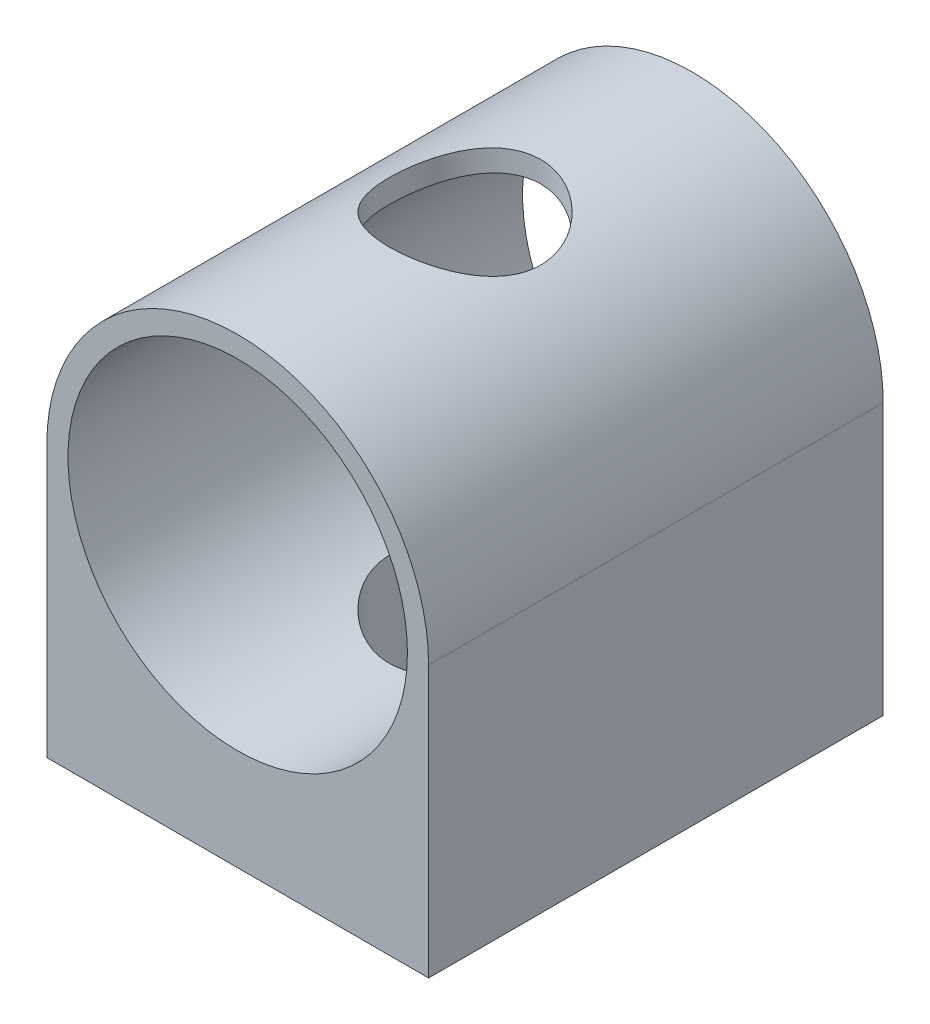
ISO-10303-21;
HEADER;
FILE_DESCRIPTION(('STEP AP214'),'2;1');
FILE_NAME('part.step','',(''),(''),'','','');
FILE_SCHEMA(('AUTOMOTIVE_DESIGN { 1 0 10303 214 1 1 1 1 }'));
ENDSEC;
DATA;
#1=APPLICATION_CONTEXT('core data for automotive mechanical design processes');
#2=APPLICATION_PROTOCOL_DEFINITION('international standard','automotive_design',2000,#1);
#3=PRODUCT_CONTEXT('',#1,'mechanical');
#4=PRODUCT('Part','Part','',(#3));
#5=PRODUCT_RELATED_PRODUCT_CATEGORY('part','',(#4));
#6=PRODUCT_DEFINITION_FORMATION('','',#4);
#7=PRODUCT_DEFINITION_CONTEXT('part definition',#1,'design');
#8=PRODUCT_DEFINITION('design','',#6,#7);
#9=PRODUCT_DEFINITION_SHAPE('','',#8);
#10=(LENGTH_UNIT() NAMED_UNIT(*) SI_UNIT(.MILLI.,.METRE.));
#11=(NAMED_UNIT(*) PLANE_ANGLE_UNIT() SI_UNIT($,.RADIAN.));
#12=(NAMED_UNIT(*) SI_UNIT($,.STERADIAN.) SOLID_ANGLE_UNIT());
#13=UNCERTAINTY_MEASURE_WITH_UNIT(LENGTH_MEASURE(1.E-05),#10,'distance_accuracy_value','');
#14=(GEOMETRIC_REPRESENTATION_CONTEXT(3) GLOBAL_UNCERTAINTY_ASSIGNED_CONTEXT((#13)) GLOBAL_UNIT_ASSIGNED_CONTEXT((#10,
#11,#12)) REPRESENTATION_CONTEXT('',''));
#15=CARTESIAN_POINT('',(0.,0.,0.));
#16=DIRECTION('',(0.,0.,1.));
#17=DIRECTION('',(1.,0.,0.));
#18=AXIS2_PLACEMENT_3D('',#15,#16,#17);
#19=CARTESIAN_POINT('',(0.,22.7096,38.1));
#20=DIRECTION('',(0.,0.,-1.));
#21=DIRECTION('',(-1.,0.,0.));
#22=AXIS2_PLACEMENT_3D('',#19,#20,#21);
#23=CYLINDRICAL_SURFACE('',#22,16.);
#24=CARTESIAN_POINT('',(0.,38.7096,12.7));
#25=CARTESIAN_POINT('',(-0.170861312202262,38.709599043328,12.7000012262265));
#26=CARTESIAN_POINT('',(-0.341776530837453,38.7068556430779,12.7069051153827));
#27=CARTESIAN_POINT('',(-0.682395770162633,38.695950644064,12.7344586577073));
#28=CARTESIAN_POINT('',(-0.852098982936762,38.6877857202998,12.7551167462964));
#29=CARTESIAN_POINT('',(-1.18930725405154,38.6662332196404,12.8100254293467));
#30=CARTESIAN_POINT('',(-1.3568072688556,38.6528352871156,12.8443029777687));
#31=CARTESIAN_POINT('',(-1.68812912054467,38.6211659584417,12.9261243454308));
#32=CARTESIAN_POINT('',(-1.85194943642102,38.6028925858006,12.9736735453292));
#33=CARTESIAN_POINT('',(-2.17415881861672,38.5620229148839,13.081391722777));
#34=CARTESIAN_POINT('',(-2.3325653637188,38.5394424677403,13.1415145022246));
#35=CARTESIAN_POINT('',(-2.64363131789985,38.4904751228965,13.2739886496563));
#36=CARTESIAN_POINT('',(-2.79628855542638,38.4640868047642,13.3463445826527));
#37=CARTESIAN_POINT('',(-3.09480551100628,38.4081736303095,13.5026549850836));
#38=CARTESIAN_POINT('',(-3.24067003972653,38.3786510438463,13.5866010739078));
#39=CARTESIAN_POINT('',(-3.52494064653913,38.3171618173969,13.7655381126562));
#40=CARTESIAN_POINT('',(-3.66334399949079,38.2851942945891,13.8605330586293));
#41=CARTESIAN_POINT('',(-4.07750762283226,38.1839883885454,14.1696088303929));
#42=CARTESIAN_POINT('',(-4.33974143093637,38.1118706176638,14.4012666241225));
#43=CARTESIAN_POINT('',(-4.82278664246711,37.9675328963272,14.9045262286927));
#44=CARTESIAN_POINT('',(-5.04357869030205,37.8953129139209,15.17614659914));
#45=CARTESIAN_POINT('',(-5.34388377896921,37.7912051461428,15.6150670500334));
#46=CARTESIAN_POINT('',(-5.44051079968249,37.7565273110308,15.770238276024));
#47=CARTESIAN_POINT('',(-5.62026090038177,37.6903154436988,16.088821936644));
#48=CARTESIAN_POINT('',(-5.70338952722931,37.6587801222018,16.2522309497807));
#49=CARTESIAN_POINT('',(-5.85544182567696,37.5998806276356,16.5862656758467));
#50=CARTESIAN_POINT('',(-5.92436442582577,37.5725167692282,16.7568919319482));
#51=CARTESIAN_POINT('',(-6.04729484179053,37.5229258228666,17.1040781793128));
#52=CARTESIAN_POINT('',(-6.10131009325503,37.5006961749214,17.2806351629073));
#53=CARTESIAN_POINT('',(-6.19181425751467,37.4630312115089,17.6304526824964));
#54=CARTESIAN_POINT('',(-6.22897459218138,37.4473381503095,17.8035117801317));
#55=CARTESIAN_POINT('',(-6.28874309778733,37.4219339012518,18.1524863904489));
#56=CARTESIAN_POINT('',(-6.31135781337091,37.4122200232094,18.3284005819328));
#57=CARTESIAN_POINT('',(-6.34178916095858,37.3991196002584,18.68170417215));
#58=CARTESIAN_POINT('',(-6.34960880620162,37.3957317669573,18.8590932631045));
#59=CARTESIAN_POINT('',(-6.35036248913086,37.395406015646,19.2139049208976));
#60=CARTESIAN_POINT('',(-6.34329720541543,37.3984678036,19.3913274858416));
#61=CARTESIAN_POINT('',(-6.3153647696582,37.4104970709356,19.7325982844976));
#62=CARTESIAN_POINT('',(-6.29547773947501,37.4190449835049,19.8965427266339));
#63=CARTESIAN_POINT('',(-6.24306728193208,37.4413657380813,20.2220926412286));
#64=CARTESIAN_POINT('',(-6.2105396907535,37.4551403017192,20.3836973247539));
#65=CARTESIAN_POINT('',(-6.13317486135991,37.4874861772289,20.7033934097786));
#66=CARTESIAN_POINT('',(-6.08834061368485,37.5060563237004,20.8614856547315));
#67=CARTESIAN_POINT('',(-5.98674297513237,37.547454134367,21.1732768957367));
#68=CARTESIAN_POINT('',(-5.92997500245535,37.5702834334288,21.3269741785777));
#69=CARTESIAN_POINT('',(-5.80374148721631,37.6200418224411,21.6320285876702));
#70=CARTESIAN_POINT('',(-5.73404646211998,37.6470432379367,21.7832788602833));
#71=CARTESIAN_POINT('',(-5.58324269734292,37.7040622490555,22.0794432470055));
#72=CARTESIAN_POINT('',(-5.50213009090664,37.7340808655155,22.2243551926505));
#73=CARTESIAN_POINT('',(-5.32904345677988,37.7963409559348,22.5070609140729));
#74=CARTESIAN_POINT('',(-5.23706800297398,37.8285827215257,22.6448537518061));
#75=CARTESIAN_POINT('',(-5.04281731288829,37.8944777238708,22.9126228920072));
#76=CARTESIAN_POINT('',(-4.94054155350033,37.9281310322605,23.0425987969509));
#77=CARTESIAN_POINT('',(-4.71807865780254,37.998627513027,23.3036860566165));
#78=CARTESIAN_POINT('',(-4.59712044782472,38.0355182762276,23.4341285528025));
#79=CARTESIAN_POINT('',(-4.34468446281968,38.1089827791516,23.6844148407742));
#80=CARTESIAN_POINT('',(-4.21320981254515,38.1455566094918,23.8042617587088));
#81=CARTESIAN_POINT('',(-3.94038183385994,38.2174463770338,24.0327266500398));
#82=CARTESIAN_POINT('',(-3.79902291543887,38.2527615851025,24.1413381818033));
#83=CARTESIAN_POINT('',(-3.50736624204196,38.3211600070704,24.3464757116519));
#84=CARTESIAN_POINT('',(-3.35707209229006,38.3542441098384,24.4430065359464));
#85=CARTESIAN_POINT('',(-3.04534665939045,38.4179309245192,24.625085658418));
#86=CARTESIAN_POINT('',(-2.88375437869337,38.4484719687789,24.7103803544405));
#87=CARTESIAN_POINT('',(-2.55328429322685,38.5054487448903,24.8669281491802));
#88=CARTESIAN_POINT('',(-2.38440944762515,38.5318861244935,24.9381868868872));
#89=CARTESIAN_POINT('',(-2.04054543409784,38.5798961992803,25.0660045725695));
#90=CARTESIAN_POINT('',(-1.86555744934644,38.6014698298648,25.1225663473982));
#91=CARTESIAN_POINT('',(-1.510782536292,38.6391117916624,25.2204042195122));
#92=CARTESIAN_POINT('',(-1.33099593529772,38.6551804973317,25.2616813565052));
#93=CARTESIAN_POINT('',(-0.978705290553125,38.6805574184353,25.3265289286285));
#94=CARTESIAN_POINT('',(-0.806389903976416,38.6902059226333,25.3509933942444));
#95=CARTESIAN_POINT('',(-0.46011467234715,38.7039212259755,25.3856978720066));
#96=CARTESIAN_POINT('',(-0.28615490710707,38.7079882946369,25.3959385709925));
#97=CARTESIAN_POINT('',(0.0620189041538971,38.7104267434407,25.4020834424189));
#98=CARTESIAN_POINT('',(0.236232886872477,38.708799358178,25.3979907224385));
#99=CARTESIAN_POINT('',(0.58358927634936,38.6998972246188,25.3755206939272));
#100=CARTESIAN_POINT('',(0.756731703019357,38.6926225815794,25.3571436516363));
#101=CARTESIAN_POINT('',(1.09298165708702,38.6730735964147,25.3074343151066));
#102=CARTESIAN_POINT('',(1.25619372464942,38.6610352464378,25.2767125951425));
#103=CARTESIAN_POINT('',(1.57937361677899,38.6322852568071,25.2026879499187));
#104=CARTESIAN_POINT('',(1.73934036048702,38.6155720867393,25.1593809043706));
#105=CARTESIAN_POINT('',(2.05489920216421,38.5778902359754,25.0605921213468));
#106=CARTESIAN_POINT('',(2.21049249792092,38.5569227336314,25.005113754702));
#107=CARTESIAN_POINT('',(2.51646945889709,38.5112240208074,24.8824148524431));
#108=CARTESIAN_POINT('',(2.66685111666824,38.4864913794031,24.8151898511313));
#109=CARTESIAN_POINT('',(2.96593144464977,38.4330543478335,24.6673311823123));
#110=CARTESIAN_POINT('',(3.11444334387994,38.404252847103,24.5863549375562));
#111=CARTESIAN_POINT('',(3.40419071895505,38.3439658091035,24.4130675223671));
#112=CARTESIAN_POINT('',(3.54542367688184,38.3124793529256,24.3207524664994));
#113=CARTESIAN_POINT('',(3.81983494449165,38.2475774985433,24.1254045708746));
#114=CARTESIAN_POINT('',(3.95301190800878,38.2141617797702,24.0223699476465));
#115=CARTESIAN_POINT('',(4.21060552246683,38.1461977080394,23.8062142478614));
#116=CARTESIAN_POINT('',(4.33502179933754,38.1116493068097,23.693092741074));
#117=CARTESIAN_POINT('',(4.5822714746113,38.0399757006974,23.4496944712885));
#118=CARTESIAN_POINT('',(4.70447181338758,38.0028294585885,23.3187799407483));
#119=CARTESIAN_POINT('',(4.93743044758057,37.9292157183176,23.0470364612911));
#120=CARTESIAN_POINT('',(5.04819230918582,37.8927480115324,22.9062106255987));
#121=CARTESIAN_POINT('',(5.2576647030766,37.8214897220194,22.6153330987166));
#122=CARTESIAN_POINT('',(5.35636843607658,37.7867000921478,22.4652762734387));
#123=CARTESIAN_POINT('',(5.54090568874265,37.7198629802257,22.1569485506035));
#124=CARTESIAN_POINT('',(5.62674461936163,37.6878143477571,21.9986811443463));
#125=CARTESIAN_POINT('',(5.7856566478339,37.6271562235821,21.673311331528));
#126=CARTESIAN_POINT('',(5.85860162560473,37.5985820424278,21.5061396421106));
#127=CARTESIAN_POINT('',(5.9900124207279,37.5462019751125,21.165549891302));
#128=CARTESIAN_POINT('',(6.0484844187599,37.5223940543553,20.9921345326344));
#129=CARTESIAN_POINT('',(6.15035460081698,37.4803879899287,20.6403329592044));
#130=CARTESIAN_POINT('',(6.19375856836003,37.4621876942034,20.4619486801108));
#131=CARTESIAN_POINT('',(6.26501421402056,37.4320692313111,20.101581461426));
#132=CARTESIAN_POINT('',(6.29286716539163,37.4201505498357,19.9195988177178));
#133=CARTESIAN_POINT('',(6.33126109112654,37.4036645454593,19.5666032013181));
#134=CARTESIAN_POINT('',(6.34289148986952,37.398635069764,19.3957295149974));
#135=CARTESIAN_POINT('',(6.35230509395225,37.3945667637835,19.0535321325364));
#136=CARTESIAN_POINT('',(6.3500888714148,37.3955276859836,18.8822084552815));
#137=CARTESIAN_POINT('',(6.33183615508133,37.4034064452635,18.5404602946909));
#138=CARTESIAN_POINT('',(6.31580128536922,37.4103235823187,18.3700357080546));
#139=CARTESIAN_POINT('',(6.27009350175508,37.4298766116166,18.0313612166373));
#140=CARTESIAN_POINT('',(6.2404206429364,37.4425124807616,17.8631113030757));
#141=CARTESIAN_POINT('',(6.16915806358407,37.47248991771,17.5364444111192));
#142=CARTESIAN_POINT('',(6.1280724558307,37.4896310543757,17.3778985472037));
#143=CARTESIAN_POINT('',(6.03395186906785,37.5283048024728,17.0648942771248));
#144=CARTESIAN_POINT('',(5.980913005517,37.5498388412832,16.9104372180069));
#145=CARTESIAN_POINT('',(5.86333682263022,37.5966843825044,16.6065783818654));
#146=CARTESIAN_POINT('',(5.79880114006261,37.6219953471223,16.4571758888361));
#147=CARTESIAN_POINT('',(5.65870924800364,37.6757162574973,16.1641878091589));
#148=CARTESIAN_POINT('',(5.58314903773539,37.704127327328,16.0206043585023));
#149=CARTESIAN_POINT('',(5.33157246378825,37.7962634604685,15.5839251619779));
#150=CARTESIAN_POINT('',(5.13723630294805,37.8641451497217,15.3020032040189));
#151=CARTESIAN_POINT('',(4.70635259970448,38.003433417728,14.7734246850641));
#152=CARTESIAN_POINT('',(4.46978989963665,38.0748412555493,14.5267808449804));
#153=CARTESIAN_POINT('',(4.07925188126439,38.1814957689075,14.1801791213555));
#154=CARTESIAN_POINT('',(3.93839077270907,38.2180363985486,14.065564160115));
#155=CARTESIAN_POINT('',(3.64705884821258,38.2891187299814,13.8486146128115));
#156=CARTESIAN_POINT('',(3.49659130701243,38.3236611053857,13.7462758757887));
#157=CARTESIAN_POINT('',(3.18689171359499,38.3898044192546,13.5546012557618));
#158=CARTESIAN_POINT('',(3.02765599152599,38.4214041109611,13.4652708751925));
#159=CARTESIAN_POINT('',(2.70151378893873,38.480753399903,13.3004177813787));
#160=CARTESIAN_POINT('',(2.5346083467284,38.5085035162524,13.2248932059891));
#161=CARTESIAN_POINT('',(2.20891378860262,38.5571688759309,13.0942220663304));
#162=CARTESIAN_POINT('',(2.05065963733572,38.5784665316674,13.0378820987823));
#163=CARTESIAN_POINT('',(1.72970178125004,38.6166499389506,12.9378089499164));
#164=CARTESIAN_POINT('',(1.5669985524731,38.6335361604866,12.8940744255772));
#165=CARTESIAN_POINT('',(1.23861173002842,38.6624351809076,12.8197013279836));
#166=CARTESIAN_POINT('',(1.07293607738946,38.6744593885241,12.7890320878254));
#167=CARTESIAN_POINT('',(0.739450357600824,38.6933752527438,12.740953773931));
#168=CARTESIAN_POINT('',(0.571641598717065,38.7002699142263,12.7235369368236));
#169=CARTESIAN_POINT('',(0.33625946124026,38.7062074590537,12.7085522109113));
#170=CARTESIAN_POINT('',(0.269058624314224,38.7074788967965,12.7053460972204));
#171=CARTESIAN_POINT('',(0.134574648338729,38.7091753797746,12.7010696894364));
#172=CARTESIAN_POINT('',(0.0672915048173895,38.7096003767728,12.6999995170666));
#173=CARTESIAN_POINT('',(0.,38.7096,12.7));
#174=B_SPLINE_CURVE_WITH_KNOTS('',3,(#24,#25,#26,#27,#28,#29,#30,#31,#32,#33,#34,#35,#36,#37,
#38,#39,#40,#41,#42,#43,#44,#45,#46,#47,#48,#49,#50,#51,#52,#53,#54,#55,#56,#57,#58,#59,#60,#61,
#62,#63,#64,#65,#66,#67,#68,#69,#70,#71,#72,#73,#74,#75,#76,#77,#78,#79,#80,#81,#82,#83,#84,#85,
#86,#87,#88,#89,#90,#91,#92,#93,#94,#95,#96,#97,#98,#99,#100,#101,#102,#103,#104,#105,#106,#107,
#108,#109,#110,#111,#112,#113,#114,#115,#116,#117,#118,#119,#120,#121,#122,#123,#124,#125,#126,
#127,#128,#129,#130,#131,#132,#133,#134,#135,#136,#137,#138,#139,#140,#141,#142,#143,#144,#145,
#146,#147,#148,#149,#150,#151,#152,#153,#154,#155,#156,#157,#158,#159,#160,#161,#162,#163,#164,
#165,#166,#167,#168,#169,#170,#171,#172,#173),.UNSPECIFIED.,.T.,.F.,(4,2,2,2,2,2,2,2,2,2,2,2,2,
2,2,2,2,2,2,2,2,2,2,2,2,2,2,2,2,2,2,2,2,2,2,2,2,2,2,2,2,2,2,2,2,2,2,2,2,2,2,2,2,2,2,2,2,2,2,2,2,
2,2,2,2,2,2,2,2,2,2,2,2,2,4),(0.,0.512516764918457,1.025348145151,1.53919955431165,
2.05325959500886,2.56546304466988,3.07785805547786,3.58988448537833,4.10209667952118,
5.1688840092163,6.23616835441497,6.79375113152952,7.35110419950001,7.90849928895488,
8.46561585030638,8.99800799181792,9.53016042134932,10.0622044583505,10.5942242401869,
11.0897451329142,11.5854293894765,12.0809933003323,12.5767478251856,13.0823337569653,
13.5880913277197,14.093915370189,14.59976511425,15.1441790935061,15.6884319075357,
16.2329950508391,16.7773399434453,17.3324004680885,17.8872375385543,18.4419678110279,
18.9966603421198,19.5189270867001,20.0411686110975,20.563296917119,21.0854154916254,
21.5843830248245,22.0835140985422,22.5825071126977,23.0816902425362,23.5958925422322,
24.1102715361684,24.6247362473259,25.13922291217,25.6872817585697,26.235169216819,
26.7833642033105,27.3313279672532,27.884463031449,28.4373614704226,28.9900474567648,
29.5426881848008,30.0560632525193,30.5694171084471,31.0827106389288,31.5960020962542,
32.0894837351805,32.583125976472,33.0766979954505,33.570449578202,34.6129160496242,
35.6557574807375,36.2109084089216,36.7658710916147,37.3210678415971,37.8761896505648,
38.3836104729646,38.890977213235,39.3971464088552,39.9030188574572,40.1048554152466,
40.3067034750032),.UNSPECIFIED.);
#175=CARTESIAN_POINT('',(0.,38.7096,12.7));
#176=VERTEX_POINT('',#175);
#177=EDGE_CURVE('E110',#176,#176,#174,.T.);
#178=ORIENTED_EDGE('',*,*,#177,.F.);
#179=EDGE_LOOP('',(#178));
#180=FACE_BOUND('',#179,.T.);
#181=CARTESIAN_POINT('',(0.,22.7096,0.));
#182=DIRECTION('',(0.,0.,1.));
#183=DIRECTION('',(1.,0.,0.));
#184=AXIS2_PLACEMENT_3D('',#181,#182,#183);
#185=CIRCLE('',#184,16.);
#186=CARTESIAN_POINT('',(-16.,22.7096,0.));
#187=VERTEX_POINT('',#186);
#188=CARTESIAN_POINT('',(16.,22.7096,0.));
#189=VERTEX_POINT('',#188);
#190=EDGE_CURVE('E109',#187,#189,#185,.F.);
#191=ORIENTED_EDGE('',*,*,#190,.F.);
#192=DIRECTION('',(0.,0.,-1.));
#193=VECTOR('',#192,1.);
#194=CARTESIAN_POINT('',(-16.,22.7096,38.1));
#195=LINE('',#194,#193);
#196=CARTESIAN_POINT('',(-16.,22.7096,38.1));
#197=VERTEX_POINT('',#196);
#198=EDGE_CURVE('E11',#197,#187,#195,.T.);
#199=ORIENTED_EDGE('',*,*,#198,.F.);
#200=CARTESIAN_POINT('',(0.,22.7096,38.1));
#201=DIRECTION('',(0.,0.,1.));
#202=DIRECTION('',(1.,0.,0.));
#203=AXIS2_PLACEMENT_3D('',#200,#201,#202);
#204=CIRCLE('',#203,16.);
#205=CARTESIAN_POINT('',(16.,22.7096,38.1));
#206=VERTEX_POINT('',#205);
#207=EDGE_CURVE('E99',#197,#206,#204,.F.);
#208=ORIENTED_EDGE('',*,*,#207,.T.);
#209=DIRECTION('',(0.,0.,-1.));
#210=VECTOR('',#209,1.);
#211=CARTESIAN_POINT('',(16.,22.7096,38.1));
#212=LINE('',#211,#210);
#213=EDGE_CURVE('E80',#206,#189,#212,.T.);
#214=ORIENTED_EDGE('',*,*,#213,.T.);
#215=EDGE_LOOP('',(#191,#199,#208,#214));
#216=FACE_BOUND('',#215,.T.);
#217=ADVANCED_FACE('F34',(#180,#216),#23,.T.);
#218=CARTESIAN_POINT('',(-16.,0.,38.1));
#219=DIRECTION('',(-1.,0.,0.));
#220=DIRECTION('',(0.,0.,1.));
#221=AXIS2_PLACEMENT_3D('',#218,#219,#220);
#222=PLANE('',#221);
#223=DIRECTION('',(0.,1.,0.));
#224=VECTOR('',#223,1.);
#225=CARTESIAN_POINT('',(-16.,0.,0.));
#226=LINE('',#225,#224);
#227=CARTESIAN_POINT('',(-16.,0.,0.));
#228=VERTEX_POINT('',#227);
#229=EDGE_CURVE('E91',#228,#187,#226,.T.);
#230=ORIENTED_EDGE('',*,*,#229,.F.);
#231=DIRECTION('',(0.,0.,-1.));
#232=VECTOR('',#231,1.);
#233=CARTESIAN_POINT('',(-16.,0.,38.1));
#234=LINE('',#233,#232);
#235=CARTESIAN_POINT('',(-16.,0.,38.1));
#236=VERTEX_POINT('',#235);
#237=EDGE_CURVE('E49',#236,#228,#234,.T.);
#238=ORIENTED_EDGE('',*,*,#237,.F.);
#239=DIRECTION('',(0.,1.,0.));
#240=VECTOR('',#239,1.);
#241=CARTESIAN_POINT('',(-16.,0.,38.1));
#242=LINE('',#241,#240);
#243=EDGE_CURVE('E89',#236,#197,#242,.T.);
#244=ORIENTED_EDGE('',*,*,#243,.T.);
#245=ORIENTED_EDGE('',*,*,#198,.T.);
#246=EDGE_LOOP('',(#230,#238,#244,#245));
#247=FACE_BOUND('',#246,.T.);
#248=ADVANCED_FACE('F88',(#247),#222,.T.);
#249=CARTESIAN_POINT('',(0.,0.,38.1));
#250=DIRECTION('',(0.,-1.,0.));
#251=DIRECTION('',(0.,0.,-1.));
#252=AXIS2_PLACEMENT_3D('',#249,#250,#251);
#253=PLANE('',#252);
#254=CARTESIAN_POINT('',(0.,0.,19.05));
#255=DIRECTION('',(0.,-1.,0.));
#256=DIRECTION('',(0.,0.,-1.));
#257=AXIS2_PLACEMENT_3D('',#254,#255,#256);
#258=CIRCLE('',#257,6.35);
#259=CARTESIAN_POINT('',(0.,0.,12.7));
#260=VERTEX_POINT('',#259);
#261=EDGE_CURVE('E125',#260,#260,#258,.T.);
#262=ORIENTED_EDGE('',*,*,#261,.F.);
#263=EDGE_LOOP('',(#262));
#264=FACE_BOUND('',#263,.T.);
#265=DIRECTION('',(-1.,0.,0.));
#266=VECTOR('',#265,1.);
#267=CARTESIAN_POINT('',(0.,0.,0.));
#268=LINE('',#267,#266);
#269=CARTESIAN_POINT('',(16.,0.,0.));
#270=VERTEX_POINT('',#269);
#271=EDGE_CURVE('E114',#270,#228,#268,.T.);
#272=ORIENTED_EDGE('',*,*,#271,.F.);
#273=DIRECTION('',(0.,0.,-1.));
#274=VECTOR('',#273,1.);
#275=CARTESIAN_POINT('',(16.,0.,38.1));
#276=LINE('',#275,#274);
#277=CARTESIAN_POINT('',(16.,0.,38.1));
#278=VERTEX_POINT('',#277);
#279=EDGE_CURVE('E73',#278,#270,#276,.T.);
#280=ORIENTED_EDGE('',*,*,#279,.F.);
#281=DIRECTION('',(-1.,0.,0.));
#282=VECTOR('',#281,1.);
#283=CARTESIAN_POINT('',(0.,0.,38.1));
#284=LINE('',#283,#282);
#285=EDGE_CURVE('E98',#278,#236,#284,.T.);
#286=ORIENTED_EDGE('',*,*,#285,.T.);
#287=ORIENTED_EDGE('',*,*,#237,.T.);
#288=EDGE_LOOP('',(#272,#280,#286,#287));
#289=FACE_BOUND('',#288,.T.);
#290=ADVANCED_FACE('F101',(#264,#289),#253,.T.);
#291=CARTESIAN_POINT('',(0.,22.7096,38.1));
#292=DIRECTION('',(0.,0.,-1.));
#293=DIRECTION('',(-1.,0.,0.));
#294=AXIS2_PLACEMENT_3D('',#291,#292,#293);
#295=CYLINDRICAL_SURFACE('',#294,14.224);
#296=CARTESIAN_POINT('',(0.,36.9336,12.7));
#297=CARTESIAN_POINT('',(0.169064131729769,36.9335989454365,12.7000012584684));
#298=CARTESIAN_POINT('',(0.338170293414768,36.9305778895958,12.7067605937601));
#299=CARTESIAN_POINT('',(0.675164422776245,36.9185685890767,12.7337310123368));
#300=CARTESIAN_POINT('',(0.84305164561125,36.9095769629898,12.7539497182984));
#301=CARTESIAN_POINT('',(1.17659843144288,36.8858405036873,12.8076686612514));
#302=CARTESIAN_POINT('',(1.3422532667633,36.8710849937836,12.8411935477124));
#303=CARTESIAN_POINT('',(1.66989459320146,36.8361985270013,12.9211824801619));
#304=CARTESIAN_POINT('',(1.83187955533246,36.8160653727319,12.9676518157917));
#305=CARTESIAN_POINT('',(2.1503925253457,36.7710279364772,13.0728494579981));
#306=CARTESIAN_POINT('',(2.30693987451225,36.7461431859962,13.1315276654265));
#307=CARTESIAN_POINT('',(2.61436305128336,36.6921481897339,13.2607493484293));
#308=CARTESIAN_POINT('',(2.76523672788118,36.6630363613131,13.3312972696622));
#309=CARTESIAN_POINT('',(3.06032218322675,36.6012990738707,13.4836301388976));
#310=CARTESIAN_POINT('',(3.20453829419942,36.5686759471269,13.5654076378157));
#311=CARTESIAN_POINT('',(3.48569666746665,36.5006499149219,13.739651131281));
#312=CARTESIAN_POINT('',(3.62263625501127,36.4652459989702,13.8321210170725));
#313=CARTESIAN_POINT('',(4.03500412909824,36.3523491781487,14.1345977715936));
#314=CARTESIAN_POINT('',(4.29702558535442,36.2714075704459,14.3619816936049));
#315=CARTESIAN_POINT('',(4.78065056902209,36.1085880389265,14.8562507051933));
#316=CARTESIAN_POINT('',(5.00222978854212,36.0267095832257,15.1231593777922));
#317=CARTESIAN_POINT('',(5.30621568033236,35.9072917762748,15.5571098361733));
#318=CARTESIAN_POINT('',(5.40507304101554,35.8670063970087,15.7120993110015));
#319=CARTESIAN_POINT('',(5.58927624131655,35.7898190265538,16.0306777193701));
#320=CARTESIAN_POINT('',(5.67462772885047,35.7529156238141,16.1942630199631));
#321=CARTESIAN_POINT('',(5.83107812880833,35.6837292300982,16.5290528050544));
#322=CARTESIAN_POINT('',(5.90217701861777,35.651446246453,16.7002573016415));
#323=CARTESIAN_POINT('',(6.02935119148151,35.5926901247516,17.0490376298518));
#324=CARTESIAN_POINT('',(6.08543458216381,35.5662138527603,17.2266099641824));
#325=CARTESIAN_POINT('',(6.17941066513844,35.5212989603364,17.5773823848697));
#326=CARTESIAN_POINT('',(6.21810297278447,35.5025116873767,17.7503235267035));
#327=CARTESIAN_POINT('',(6.28093882906494,35.471778960995,18.0993533745766));
#328=CARTESIAN_POINT('',(6.30508940813675,35.4598302015199,18.2754405171617));
#329=CARTESIAN_POINT('',(6.33853971923257,35.4432342324333,18.6293011454056));
#330=CARTESIAN_POINT('',(6.347844744329,35.4385844204456,18.807074007282));
#331=CARTESIAN_POINT('',(6.35148865273605,35.4367668063681,19.1628057756843));
#332=CARTESIAN_POINT('',(6.34582851131983,35.4395985167108,19.340764669331));
#333=CARTESIAN_POINT('',(6.32081807462496,35.4520330938839,19.6791934553593));
#334=CARTESIAN_POINT('',(6.30275741103481,35.4609978428272,19.8397842428957));
#335=CARTESIAN_POINT('',(6.25453306144935,35.4847209170416,20.1587562469355));
#336=CARTESIAN_POINT('',(6.22436546854594,35.4994811124708,20.3171367330857));
#337=CARTESIAN_POINT('',(6.15225191906018,35.5343249950343,20.6305539174411));
#338=CARTESIAN_POINT('',(6.11030831443204,35.554407619106,20.7855912766983));
#339=CARTESIAN_POINT('',(6.01502717545125,35.5993011825212,21.0914762718885));
#340=CARTESIAN_POINT('',(5.96168522056779,35.6241139559167,21.2423222565925));
#341=CARTESIAN_POINT('',(5.84276161844015,35.678357486444,21.5422318062413));
#342=CARTESIAN_POINT('',(5.77693555937324,35.7078781705812,21.6911823329245));
#343=CARTESIAN_POINT('',(5.63437970471473,35.7703046943084,21.9830336632301));
#344=CARTESIAN_POINT('',(5.55764624601261,35.8032116701121,22.1259324134297));
#345=CARTESIAN_POINT('',(5.31177387979408,35.9057624273931,22.5445848151583));
#346=CARTESIAN_POINT('',(5.12690085590811,35.9792656267034,22.8104502785898));
#347=CARTESIAN_POINT('',(4.81162285348535,36.0955891191241,23.1975596586336));
#348=CARTESIAN_POINT('',(4.69417522661855,36.1373224376545,23.3300191311469));
#349=CARTESIAN_POINT('',(4.44861453742545,36.22066185828,23.5847069200473));
#350=CARTESIAN_POINT('',(4.32050443238618,36.2622679923533,23.7069380545738));
#351=CARTESIAN_POINT('',(4.0542217604112,36.3442942414802,23.9405203103953));
#352=CARTESIAN_POINT('',(3.91604244673153,36.3847135353872,24.0518640175235));
#353=CARTESIAN_POINT('',(3.63048073575632,36.4632795817658,24.2628306850293));
#354=CARTESIAN_POINT('',(3.48310204162087,36.501427236743,24.3624583156632));
#355=CARTESIAN_POINT('',(3.17526288425157,36.5755908790356,24.5521709467576));
#356=CARTESIAN_POINT('',(3.01454010990181,36.6115059080407,24.6418706226948));
#357=CARTESIAN_POINT('',(2.68521731677174,36.6788524691579,24.8072599733338));
#358=CARTESIAN_POINT('',(2.51662057970846,36.7102858473847,24.882955420607));
#359=CARTESIAN_POINT('',(2.17271141392278,36.7677606990394,25.0195936883149));
#360=CARTESIAN_POINT('',(1.99740095412563,36.793803739151,25.0805407961786));
#361=CARTESIAN_POINT('',(1.64137231314383,36.8397194515932,25.187011509479));
#362=CARTESIAN_POINT('',(1.46065461419103,36.8595926723768,25.2325364858665));
#363=CARTESIAN_POINT('',(1.10819523205099,36.8913894834687,25.3049545109972));
#364=CARTESIAN_POINT('',(0.936717799404799,36.9037743880478,25.3329339864719));
#365=CARTESIAN_POINT('',(0.591718289173312,36.9223365162427,25.374757440742));
#366=CARTESIAN_POINT('',(0.418196346100833,36.9285141459667,25.3886023442868));
#367=CARTESIAN_POINT('',(0.070542038448959,36.9344872665467,25.4019900293324));
#368=CARTESIAN_POINT('',(-0.103590138006335,36.9342845763468,25.4015368870155));
#369=CARTESIAN_POINT('',(-0.451102210308929,36.9275070847327,25.3863438027949));
#370=CARTESIAN_POINT('',(-0.624482127604828,36.9209324662118,25.371604270953));
#371=CARTESIAN_POINT('',(-0.958925872296469,36.9021691248647,25.3293053577421));
#372=CARTESIAN_POINT('',(-1.12011268888394,36.8903346182034,25.3025538785558));
#373=CARTESIAN_POINT('',(-1.43955285914873,36.8614758560333,25.2368236092749));
#374=CARTESIAN_POINT('',(-1.59780524879768,36.8444499259763,25.1978408737422));
#375=CARTESIAN_POINT('',(-1.91025786414708,36.805623195584,25.1080385783599));
#376=CARTESIAN_POINT('',(-2.06445925291635,36.7838237829035,25.057222458212));
#377=CARTESIAN_POINT('',(-2.36799407551974,36.7359467006255,24.9441790348239));
#378=CARTESIAN_POINT('',(-2.51732562549471,36.7098673983777,24.8819473758245));
#379=CARTESIAN_POINT('',(-2.81475768702214,36.6531621901501,24.7444966475365));
#380=CARTESIAN_POINT('',(-2.96267895853888,36.6224210839485,24.6689368981564));
#381=CARTESIAN_POINT('',(-3.25165385011778,36.5577366043457,24.5068054138304));
#382=CARTESIAN_POINT('',(-3.39270491851985,36.5237920546987,24.4202296299029));
#383=CARTESIAN_POINT('',(-3.80444154846649,36.4183013216744,24.1448666847058));
#384=CARTESIAN_POINT('',(-4.06387255196499,36.343065876444,23.9403685703045));
#385=CARTESIAN_POINT('',(-4.56717971985251,36.1832195924533,23.4760497028239));
#386=CARTESIAN_POINT('',(-4.80807968829956,36.098343660402,23.2130841014305));
#387=CARTESIAN_POINT('',(-5.13436921385734,35.9751200786573,22.790658053443));
#388=CARTESIAN_POINT('',(-5.23735015928865,35.9346997857719,22.6450720928674));
#389=CARTESIAN_POINT('',(-5.43096216440055,35.8563756913302,22.3452916270019));
#390=CARTESIAN_POINT('',(-5.52159808495032,35.8184709023231,22.1911005439004));
#391=CARTESIAN_POINT('',(-5.6919259511535,35.7454338851607,21.8710214590693));
#392=CARTESIAN_POINT('',(-5.77129071415856,35.7103937377191,21.7049382002682));
#393=CARTESIAN_POINT('',(-5.91556212889422,35.6453861183189,21.3657227858259));
#394=CARTESIAN_POINT('',(-5.98047518484889,35.615416400836,21.1925937928701));
#395=CARTESIAN_POINT('',(-6.09513432155158,35.5616631516823,20.8405544452413));
#396=CARTESIAN_POINT('',(-6.14488936920736,35.5378759638874,20.6616475780978));
#397=CARTESIAN_POINT('',(-6.22864768874855,35.497418287225,20.2993978039327));
#398=CARTESIAN_POINT('',(-6.26265276275062,35.480746984173,20.1160554069531));
#399=CARTESIAN_POINT('',(-6.31222710443848,35.4563116124661,19.7623282470812));
#400=CARTESIAN_POINT('',(-6.32912158768412,35.4479090273014,19.5921723084182));
#401=CARTESIAN_POINT('',(-6.34912391978851,35.4379514305887,19.2508558559243));
#402=CARTESIAN_POINT('',(-6.35223267108621,35.4363959708155,19.0796954085849));
#403=CARTESIAN_POINT('',(-6.34462473222798,35.4401903066576,18.7377942729185));
#404=CARTESIAN_POINT('',(-6.33391064813108,35.4455388006507,18.5670535115467));
#405=CARTESIAN_POINT('',(-6.29879998872588,35.4629398469021,18.2273347676571));
#406=CARTESIAN_POINT('',(-6.27440363643877,35.4749922898861,18.0583567564522));
#407=CARTESIAN_POINT('',(-6.21414570374575,35.5044276807417,17.7337774527205));
#408=CARTESIAN_POINT('',(-6.17908212900159,35.521436924727,17.5779929273758));
#409=CARTESIAN_POINT('',(-6.0975108398573,35.5604591355222,17.2700438069406));
#410=CARTESIAN_POINT('',(-6.05099947412218,35.5824736986345,17.1178803838355));
#411=CARTESIAN_POINT('',(-5.94695821933483,35.6308674037334,16.8181057847019));
#412=CARTESIAN_POINT('',(-5.88942977445863,35.6572459736017,16.6704940149602));
#413=CARTESIAN_POINT('',(-5.76380680383267,35.7136549581279,16.3805380439067));
#414=CARTESIAN_POINT('',(-5.69570841117874,35.7436867083902,16.2381957940912));
#415=CARTESIAN_POINT('',(-5.46689995021054,35.8421516547723,15.8023043550487));
#416=CARTESIAN_POINT('',(-5.28828946531234,35.9157290912658,15.5190800009564));
#417=CARTESIAN_POINT('',(-4.88973585599202,36.0684197028986,14.9850131645655));
#418=CARTESIAN_POINT('',(-4.66977527247781,36.1475352074664,14.7341844362932));
#419=CARTESIAN_POINT('',(-4.30178572595674,36.268196272528,14.3756008647866));
#420=CARTESIAN_POINT('',(-4.16658201765511,36.3104527591879,14.2546863842491));
#421=CARTESIAN_POINT('',(-3.88602995057585,36.3932509839816,14.0246496612435));
#422=CARTESIAN_POINT('',(-3.74068515697119,36.4337933167689,13.9155233086107));
#423=CARTESIAN_POINT('',(-3.44051666705063,36.5121036243447,13.709728942519));
#424=CARTESIAN_POINT('',(-3.28568426105106,36.5498689777215,13.6130726372172));
#425=CARTESIAN_POINT('',(-2.96765193535108,36.6215289609799,13.4331593885596));
#426=CARTESIAN_POINT('',(-2.80445593202991,36.6554253789799,13.3498962478994));
#427=CARTESIAN_POINT('',(-2.47241626069171,36.7180824637683,13.1982803702248));
#428=CARTESIAN_POINT('',(-2.30364811527157,36.7468924515292,13.1297828335177));
#429=CARTESIAN_POINT('',(-1.96015685953323,36.7989616536695,13.0073593494343));
#430=CARTESIAN_POINT('',(-1.78543666428462,36.8222235418546,12.9534263812645));
#431=CARTESIAN_POINT('',(-1.43174620718753,36.8624755433288,12.8608203027023));
#432=CARTESIAN_POINT('',(-1.2527871715224,36.879480598655,12.8221108214314));
#433=CARTESIAN_POINT('',(-0.891782266010681,36.9067694062276,12.7602687189988));
#434=CARTESIAN_POINT('',(-0.709738621525267,36.9170578086529,12.7371253205453));
#435=CARTESIAN_POINT('',(-0.439369739434101,36.9270833835323,12.7146080580271));
#436=CARTESIAN_POINT('',(-0.35160841261814,36.9295250923983,12.7091322524853));
#437=CARTESIAN_POINT('',(-0.175901850736048,36.9327836849857,12.7018278735902));
#438=CARTESIAN_POINT('',(-0.0879566134123708,36.9336005486429,12.6999993452744));
#439=CARTESIAN_POINT('',(0.,36.9336,12.7));
#440=B_SPLINE_CURVE_WITH_KNOTS('',3,(#296,#297,#298,#299,#300,#301,#302,#303,#304,#305,#306,
#307,#308,#309,#310,#311,#312,#313,#314,#315,#316,#317,#318,#319,#320,#321,#322,#323,#324,#325,
#326,#327,#328,#329,#330,#331,#332,#333,#334,#335,#336,#337,#338,#339,#340,#341,#342,#343,#344,
#345,#346,#347,#348,#349,#350,#351,#352,#353,#354,#355,#356,#357,#358,#359,#360,#361,#362,#363,
#364,#365,#366,#367,#368,#369,#370,#371,#372,#373,#374,#375,#376,#377,#378,#379,#380,#381,#382,
#383,#384,#385,#386,#387,#388,#389,#390,#391,#392,#393,#394,#395,#396,#397,#398,#399,#400,#401,
#402,#403,#404,#405,#406,#407,#408,#409,#410,#411,#412,#413,#414,#415,#416,#417,#418,#419,#420,
#421,#422,#423,#424,#425,#426,#427,#428,#429,#430,#431,#432,#433,#434,#435,#436,#437,#438,#439),
.UNSPECIFIED.,.T.,.F.,(4,2,2,2,2,2,2,2,2,2,2,2,2,2,2,2,2,2,2,2,2,2,2,2,2,2,2,2,2,2,2,2,2,2,2,2,
2,2,2,2,2,2,2,2,2,2,2,2,2,2,2,2,2,2,2,2,2,2,2,2,2,2,2,2,2,2,2,2,2,2,2,4),(0.,0.507104156892432,
1.01449575541371,1.52283170822346,2.03137569379082,2.53787263049204,3.0445596935521,
3.55091225746563,4.05744967999993,5.12132603718107,6.18583974872283,6.74982329801769,
7.31357037255169,7.87731834157232,8.44076129782052,8.97466088263865,9.50830213725078,
10.0417530834684,10.5751692657851,11.0601548869978,11.5452971391577,12.0303425655267,
12.5155764456948,13.0115323922066,13.507655294428,14.4993956775397,15.0445766767953,
15.5896069683079,16.135005869107,16.6801866210055,17.2420510441736,17.8036833471365,
18.3651521836098,18.9265710951912,19.4484492051604,19.9702931692531,20.4919883639323,
21.0136685848518,21.5045616913013,21.9956133082879,22.486522365277,22.9776191266252,
23.4838257539312,23.9902189796158,25.00246679058,26.0969547422252,26.6449844220719,
27.19279768684,27.7541976911302,28.3153484155453,28.8761665368122,29.4369204732407,
29.9498392024438,30.4627243545639,30.9755128250958,31.4882929374106,31.9695150606022,
32.450890871556,32.932203624404,33.4136928772956,34.4376559457124,35.4620523331176,
36.0202141683233,36.5781807568456,37.1366674669594,37.6948950052437,38.2473704340328,
38.7995790668764,39.3504602685509,39.9009596698776,40.1647803459189,40.4286042796608),.UNSPECIFIED.);
#441=CARTESIAN_POINT('',(0.,36.9336,12.7));
#442=VERTEX_POINT('',#441);
#443=EDGE_CURVE('E39',#442,#442,#440,.T.);
#444=ORIENTED_EDGE('',*,*,#443,.F.);
#445=EDGE_LOOP('',(#444));
#446=FACE_BOUND('',#445,.T.);
#447=CARTESIAN_POINT('',(0.,8.48560000000001,12.7));
#448=CARTESIAN_POINT('',(-0.169064131729769,8.48560105456356,12.7000012584684));
#449=CARTESIAN_POINT('',(-0.338170293414768,8.48862211040417,12.7067605937601));
#450=CARTESIAN_POINT('',(-0.675164422776245,8.50063141092329,12.7337310123368));
#451=CARTESIAN_POINT('',(-0.84305164561125,8.5096230370102,12.7539497182984));
#452=CARTESIAN_POINT('',(-1.17659843144288,8.53335949631268,12.8076686612514));
#453=CARTESIAN_POINT('',(-1.3422532667633,8.54811500621646,12.8411935477124));
#454=CARTESIAN_POINT('',(-1.66989459320146,8.58300147299869,12.9211824801619));
#455=CARTESIAN_POINT('',(-1.83187955533246,8.60313462726811,12.9676518157917));
#456=CARTESIAN_POINT('',(-2.1503925253457,8.64817206352279,13.0728494579981));
#457=CARTESIAN_POINT('',(-2.30693987451225,8.67305681400376,13.1315276654265));
#458=CARTESIAN_POINT('',(-2.61436305128336,8.72705181026607,13.2607493484293));
#459=CARTESIAN_POINT('',(-2.76523672788118,8.75616363868686,13.3312972696622));
#460=CARTESIAN_POINT('',(-3.06032218322675,8.81790092612936,13.4836301388976));
#461=CARTESIAN_POINT('',(-3.20453829419942,8.85052405287306,13.5654076378157));
#462=CARTESIAN_POINT('',(-3.48569666746665,8.91855008507811,13.739651131281));
#463=CARTESIAN_POINT('',(-3.62263625501127,8.95395400102984,13.8321210170725));
#464=CARTESIAN_POINT('',(-4.03500412909824,9.06685082185132,14.1345977715936));
#465=CARTESIAN_POINT('',(-4.29702558535442,9.14779242955415,14.3619816936049));
#466=CARTESIAN_POINT('',(-4.78065056902209,9.31061196107349,14.8562507051933));
#467=CARTESIAN_POINT('',(-5.00222978854212,9.39249041677433,15.1231593777922));
#468=CARTESIAN_POINT('',(-5.30621568033236,9.51190822372516,15.5571098361733));
#469=CARTESIAN_POINT('',(-5.40507304101554,9.55219360299135,15.7120993110015));
#470=CARTESIAN_POINT('',(-5.58927624131655,9.62938097344624,16.0306777193701));
#471=CARTESIAN_POINT('',(-5.67462772885047,9.66628437618586,16.1942630199631));
#472=CARTESIAN_POINT('',(-5.83107812880833,9.73547076990185,16.5290528050544));
#473=CARTESIAN_POINT('',(-5.90217701861777,9.76775375354701,16.7002573016415));
#474=CARTESIAN_POINT('',(-6.02935119148151,9.82650987524836,17.0490376298518));
#475=CARTESIAN_POINT('',(-6.08543458216381,9.85298614723972,17.2266099641824));
#476=CARTESIAN_POINT('',(-6.17941066513843,9.89790103966358,17.5773823848697));
#477=CARTESIAN_POINT('',(-6.21810297278447,9.9166883126233,17.7503235267035));
#478=CARTESIAN_POINT('',(-6.28093882906494,9.94742103900506,18.0993533745766));
#479=CARTESIAN_POINT('',(-6.30508940813675,9.95936979848013,18.2754405171617));
#480=CARTESIAN_POINT('',(-6.33853971923257,9.97596576756672,18.6293011454055));
#481=CARTESIAN_POINT('',(-6.347844744329,9.98061557955441,18.807074007282));
#482=CARTESIAN_POINT('',(-6.35148865273605,9.98243319363191,19.1628057756843));
#483=CARTESIAN_POINT('',(-6.34582851131983,9.97960148328916,19.340764669331));
#484=CARTESIAN_POINT('',(-6.32081807462496,9.96716690611613,19.6791934553593));
#485=CARTESIAN_POINT('',(-6.30275741103481,9.95820215717278,19.8397842428957));
#486=CARTESIAN_POINT('',(-6.25453306144935,9.93447908295845,20.1587562469355));
#487=CARTESIAN_POINT('',(-6.22436546854594,9.91971888752921,20.3171367330857));
#488=CARTESIAN_POINT('',(-6.15225191906018,9.88487500496575,20.6305539174411));
#489=CARTESIAN_POINT('',(-6.11030831443204,9.86479238089402,20.7855912766983));
#490=CARTESIAN_POINT('',(-6.01502717545125,9.8198988174788,21.0914762718885));
#491=CARTESIAN_POINT('',(-5.96168522056779,9.79508604408332,21.2423222565925));
#492=CARTESIAN_POINT('',(-5.84276161844015,9.74084251355597,21.5422318062413));
#493=CARTESIAN_POINT('',(-5.77693555937324,9.71132182941885,21.6911823329245));
#494=CARTESIAN_POINT('',(-5.63437970471472,9.6488953056916,21.9830336632301));
#495=CARTESIAN_POINT('',(-5.55764624601261,9.61598832988788,22.1259324134297));
#496=CARTESIAN_POINT('',(-5.31177387979409,9.51343757260691,22.5445848151583));
#497=CARTESIAN_POINT('',(-5.12690085590811,9.4399343732966,22.8104502785898));
#498=CARTESIAN_POINT('',(-4.81162285348536,9.32361088087589,23.1975596586336));
#499=CARTESIAN_POINT('',(-4.69417522661855,9.28187756234552,23.3300191311469));
#500=CARTESIAN_POINT('',(-4.44861453742545,9.19853814171998,23.5847069200473));
#501=CARTESIAN_POINT('',(-4.32050443238618,9.15693200764672,23.7069380545738));
#502=CARTESIAN_POINT('',(-4.05422176041119,9.07490575851981,23.9405203103953));
#503=CARTESIAN_POINT('',(-3.91604244673153,9.03448646461279,24.0518640175235));
#504=CARTESIAN_POINT('',(-3.63048073575631,8.95592041823424,24.2628306850293));
#505=CARTESIAN_POINT('',(-3.48310204162086,8.91777276325701,24.3624583156632));
#506=CARTESIAN_POINT('',(-3.17526288425157,8.84360912096444,24.5521709467576));
#507=CARTESIAN_POINT('',(-3.01454010990181,8.80769409195934,24.6418706226948));
#508=CARTESIAN_POINT('',(-2.68521731677174,8.74034753084212,24.8072599733338));
#509=CARTESIAN_POINT('',(-2.51662057970846,8.70891415261532,24.882955420607));
#510=CARTESIAN_POINT('',(-2.17271141392279,8.65143930096065,25.0195936883149));
#511=CARTESIAN_POINT('',(-1.99740095412563,8.62539626084899,25.0805407961786));
#512=CARTESIAN_POINT('',(-1.64137231314383,8.57948054840684,25.187011509479));
#513=CARTESIAN_POINT('',(-1.46065461419103,8.55960732762323,25.2325364858665));
#514=CARTESIAN_POINT('',(-1.10819523205099,8.52781051653135,25.3049545109972));
#515=CARTESIAN_POINT('',(-0.936717799404804,8.51542561195221,25.3329339864719));
#516=CARTESIAN_POINT('',(-0.591718289173316,8.49686348375735,25.374757440742));
#517=CARTESIAN_POINT('',(-0.418196346100837,8.49068585403332,25.3886023442868));
#518=CARTESIAN_POINT('',(-0.0705420384489631,8.48471273345336,25.4019900293324));
#519=CARTESIAN_POINT('',(0.103590138006331,8.48491542365324,25.4015368870155));
#520=CARTESIAN_POINT('',(0.451102210308926,8.49169291526731,25.3863438027949));
#521=CARTESIAN_POINT('',(0.624482127604826,8.49826753378824,25.371604270953));
#522=CARTESIAN_POINT('',(0.958925872296468,8.51703087513536,25.3293053577421));
#523=CARTESIAN_POINT('',(1.12011268888394,8.52886538179666,25.3025538785558));
#524=CARTESIAN_POINT('',(1.43955285914873,8.55772414396674,25.2368236092749));
#525=CARTESIAN_POINT('',(1.59780524879768,8.57475007402367,25.1978408737422));
#526=CARTESIAN_POINT('',(1.91025786414708,8.61357680441599,25.1080385783599));
#527=CARTESIAN_POINT('',(2.06445925291635,8.63537621709654,25.057222458212));
#528=CARTESIAN_POINT('',(2.36799407551974,8.68325329937447,24.9441790348239));
#529=CARTESIAN_POINT('',(2.51732562549471,8.70933260162236,24.8819473758245));
#530=CARTESIAN_POINT('',(2.81475768702214,8.76603780984991,24.7444966475365));
#531=CARTESIAN_POINT('',(2.96267895853888,8.7967789160515,24.6689368981564));
#532=CARTESIAN_POINT('',(3.25165385011778,8.86146339565433,24.5068054138304));
#533=CARTESIAN_POINT('',(3.39270491851985,8.89540794530127,24.4202296299029));
#534=CARTESIAN_POINT('',(3.80444154846649,9.00089867832563,24.1448666847058));
#535=CARTESIAN_POINT('',(4.06387255196499,9.07613412355604,23.9403685703045));
#536=CARTESIAN_POINT('',(4.56717971985251,9.23598040754675,23.4760497028239));
#537=CARTESIAN_POINT('',(4.80807968829956,9.32085633959798,23.2130841014305));
#538=CARTESIAN_POINT('',(5.13436921385734,9.44407992134274,22.790658053443));
#539=CARTESIAN_POINT('',(5.23735015928865,9.4845002142281,22.6450720928674));
#540=CARTESIAN_POINT('',(5.43096216440055,9.56282430866984,22.3452916270019));
#541=CARTESIAN_POINT('',(5.52159808495032,9.6007290976769,22.1911005439004));
#542=CARTESIAN_POINT('',(5.6919259511535,9.67376611483929,21.8710214590693));
#543=CARTESIAN_POINT('',(5.77129071415856,9.7088062622809,21.7049382002682));
#544=CARTESIAN_POINT('',(5.91556212889423,9.77381388168108,21.3657227858259));
#545=CARTESIAN_POINT('',(5.9804751848489,9.803783599164,21.1925937928701));
#546=CARTESIAN_POINT('',(6.09513432155158,9.85753684831771,20.8405544452413));
#547=CARTESIAN_POINT('',(6.14488936920736,9.88132403611258,20.6616475780978));
#548=CARTESIAN_POINT('',(6.22864768874855,9.92178171277499,20.2993978039328));
#549=CARTESIAN_POINT('',(6.26265276275062,9.93845301582705,20.1160554069531));
#550=CARTESIAN_POINT('',(6.31222710443848,9.96288838753394,19.7623282470812));
#551=CARTESIAN_POINT('',(6.32912158768412,9.9712909726986,19.5921723084182));
#552=CARTESIAN_POINT('',(6.34912391978851,9.98124856941129,19.2508558559243));
#553=CARTESIAN_POINT('',(6.35223267108621,9.98280402918448,19.0796954085849));
#554=CARTESIAN_POINT('',(6.34462473222798,9.97900969334239,18.7377942729185));
#555=CARTESIAN_POINT('',(6.33391064813108,9.97366119934935,18.5670535115467));
#556=CARTESIAN_POINT('',(6.29879998872588,9.95626015309788,18.2273347676571));
#557=CARTESIAN_POINT('',(6.27440363643877,9.94420771011396,18.0583567564522));
#558=CARTESIAN_POINT('',(6.21414570374575,9.91477231925831,17.7337774527205));
#559=CARTESIAN_POINT('',(6.17908212900159,9.89776307527298,17.5779929273758));
#560=CARTESIAN_POINT('',(6.0975108398573,9.85874086447785,17.2700438069406));
#561=CARTESIAN_POINT('',(6.05099947412218,9.83672630136552,17.1178803838355));
#562=CARTESIAN_POINT('',(5.94695821933483,9.78833259626657,16.8181057847019));
#563=CARTESIAN_POINT('',(5.88942977445863,9.76195402639828,16.6704940149602));
#564=CARTESIAN_POINT('',(5.76380680383267,9.70554504187213,16.3805380439067));
#565=CARTESIAN_POINT('',(5.69570841117874,9.67551329160984,16.2381957940912));
#566=CARTESIAN_POINT('',(5.46689995021055,9.57704834522776,15.8023043550487));
#567=CARTESIAN_POINT('',(5.28828946531234,9.50347090873426,15.5190800009564));
#568=CARTESIAN_POINT('',(4.88973585599203,9.35078029710143,14.9850131645655));
#569=CARTESIAN_POINT('',(4.66977527247781,9.27166479253366,14.7341844362932));
#570=CARTESIAN_POINT('',(4.30178572595675,9.15100372747202,14.3756008647866));
#571=CARTESIAN_POINT('',(4.16658201765511,9.10874724081211,14.2546863842491));
#572=CARTESIAN_POINT('',(3.88602995057586,9.02594901601845,14.0246496612435));
#573=CARTESIAN_POINT('',(3.7406851569712,8.98540668323112,13.9155233086107));
#574=CARTESIAN_POINT('',(3.44051666705064,8.90709637565527,13.709728942519));
#575=CARTESIAN_POINT('',(3.28568426105107,8.86933102227852,13.6130726372172));
#576=CARTESIAN_POINT('',(2.96765193535108,8.79767103902014,13.4331593885596));
#577=CARTESIAN_POINT('',(2.80445593202991,8.76377462102007,13.3498962478994));
#578=CARTESIAN_POINT('',(2.47241626069171,8.70111753623168,13.1982803702248));
#579=CARTESIAN_POINT('',(2.30364811527157,8.67230754847077,13.1297828335177));
#580=CARTESIAN_POINT('',(1.96015685953323,8.62023834633054,13.0073593494343));
#581=CARTESIAN_POINT('',(1.78543666428462,8.59697645814543,12.9534263812645));
#582=CARTESIAN_POINT('',(1.43174620718754,8.55672445667117,12.8608203027023));
#583=CARTESIAN_POINT('',(1.2527871715224,8.53971940134504,12.8221108214314));
#584=CARTESIAN_POINT('',(0.891782266010683,8.51243059377239,12.7602687189988));
#585=CARTESIAN_POINT('',(0.70973862152527,8.50214219134712,12.7371253205453));
#586=CARTESIAN_POINT('',(0.439369739434102,8.49211661646774,12.7146080580271));
#587=CARTESIAN_POINT('',(0.351608412618139,8.48967490760168,12.7091322524853));
#588=CARTESIAN_POINT('',(0.175901850736047,8.48641631501436,12.7018278735902));
#589=CARTESIAN_POINT('',(0.08795661341237,8.48559945135709,12.6999993452744));
#590=CARTESIAN_POINT('',(0.,8.48560000000001,12.7));
#591=B_SPLINE_CURVE_WITH_KNOTS('',3,(#447,#448,#449,#450,#451,#452,#453,#454,#455,#456,#457,
#458,#459,#460,#461,#462,#463,#464,#465,#466,#467,#468,#469,#470,#471,#472,#473,#474,#475,#476,
#477,#478,#479,#480,#481,#482,#483,#484,#485,#486,#487,#488,#489,#490,#491,#492,#493,#494,#495,
#496,#497,#498,#499,#500,#501,#502,#503,#504,#505,#506,#507,#508,#509,#510,#511,#512,#513,#514,
#515,#516,#517,#518,#519,#520,#521,#522,#523,#524,#525,#526,#527,#528,#529,#530,#531,#532,#533,
#534,#535,#536,#537,#538,#539,#540,#541,#542,#543,#544,#545,#546,#547,#548,#549,#550,#551,#552,
#553,#554,#555,#556,#557,#558,#559,#560,#561,#562,#563,#564,#565,#566,#567,#568,#569,#570,#571,
#572,#573,#574,#575,#576,#577,#578,#579,#580,#581,#582,#583,#584,#585,#586,#587,#588,#589,#590),
.UNSPECIFIED.,.T.,.F.,(4,2,2,2,2,2,2,2,2,2,2,2,2,2,2,2,2,2,2,2,2,2,2,2,2,2,2,2,2,2,2,2,2,2,2,2,
2,2,2,2,2,2,2,2,2,2,2,2,2,2,2,2,2,2,2,2,2,2,2,2,2,2,2,2,2,2,2,2,2,2,2,4),(0.,0.507104156892432,
1.01449575541371,1.52283170822346,2.03137569379082,2.53787263049204,3.04455969355211,
3.55091225746562,4.05744967999993,5.12132603718107,6.18583974872283,6.74982329801769,
7.31357037255168,7.87731834157232,8.44076129782052,8.97466088263864,9.50830213725078,
10.0417530834684,10.5751692657851,11.0601548869978,11.5452971391577,12.0303425655267,
12.5155764456948,13.0115323922066,13.507655294428,14.4993956775397,15.0445766767953,
15.5896069683079,16.135005869107,16.6801866210055,17.2420510441736,17.8036833471365,
18.3651521836098,18.9265710951912,19.4484492051604,19.9702931692531,20.4919883639323,
21.0136685848518,21.5045616913013,21.9956133082879,22.486522365277,22.9776191266252,
23.4838257539312,23.9902189796158,25.00246679058,26.0969547422251,26.6449844220719,
27.1927976868399,27.7541976911302,28.3153484155453,28.8761665368122,29.4369204732407,
29.9498392024438,30.4627243545639,30.9755128250958,31.4882929374106,31.9695150606022,
32.450890871556,32.932203624404,33.4136928772956,34.4376559457124,35.4620523331176,
36.0202141683233,36.5781807568456,37.1366674669594,37.6948950052437,38.2473704340328,
38.7995790668764,39.3504602685509,39.9009596698776,40.1647803459189,40.4286042796607),.UNSPECIFIED.);
#592=CARTESIAN_POINT('',(0.,8.48560000000001,12.7));
#593=VERTEX_POINT('',#592);
#594=EDGE_CURVE('E120',#593,#593,#591,.T.);
#595=ORIENTED_EDGE('',*,*,#594,.F.);
#596=EDGE_LOOP('',(#595));
#597=FACE_BOUND('',#596,.T.);
#598=CARTESIAN_POINT('',(0.,22.7096,38.1));
#599=DIRECTION('',(0.,0.,1.));
#600=DIRECTION('',(1.,0.,0.));
#601=AXIS2_PLACEMENT_3D('',#598,#599,#600);
#602=CIRCLE('',#601,14.224);
#603=CARTESIAN_POINT('',(14.224,22.7096,38.1));
#604=VERTEX_POINT('',#603);
#605=EDGE_CURVE('E118',#604,#604,#602,.T.);
#606=ORIENTED_EDGE('',*,*,#605,.T.);
#607=EDGE_LOOP('',(#606));
#608=FACE_BOUND('',#607,.T.);
#609=CARTESIAN_POINT('',(0.,22.7096,0.));
#610=DIRECTION('',(0.,0.,1.));
#611=DIRECTION('',(1.,0.,0.));
#612=AXIS2_PLACEMENT_3D('',#609,#610,#611);
#613=CIRCLE('',#612,14.224);
#614=CARTESIAN_POINT('',(14.224,22.7096,0.));
#615=VERTEX_POINT('',#614);
#616=EDGE_CURVE('E106',#615,#615,#613,.T.);
#617=ORIENTED_EDGE('',*,*,#616,.F.);
#618=EDGE_LOOP('',(#617));
#619=FACE_BOUND('',#618,.T.);
#620=ADVANCED_FACE('F36',(#446,#597,#608,#619),#295,.F.);
#621=CARTESIAN_POINT('',(16.,0.,38.1));
#622=DIRECTION('',(-1.,0.,0.));
#623=DIRECTION('',(0.,-1.,0.));
#624=AXIS2_PLACEMENT_3D('',#621,#622,#623);
#625=PLANE('',#624);
#626=DIRECTION('',(0.,1.,0.));
#627=VECTOR('',#626,1.);
#628=CARTESIAN_POINT('',(16.,0.,0.));
#629=LINE('',#628,#627);
#630=EDGE_CURVE('E116',#270,#189,#629,.T.);
#631=ORIENTED_EDGE('',*,*,#630,.T.);
#632=ORIENTED_EDGE('',*,*,#213,.F.);
#633=DIRECTION('',(0.,1.,0.));
#634=VECTOR('',#633,1.);
#635=CARTESIAN_POINT('',(16.,0.,38.1));
#636=LINE('',#635,#634);
#637=EDGE_CURVE('E58',#278,#206,#636,.T.);
#638=ORIENTED_EDGE('',*,*,#637,.F.);
#639=ORIENTED_EDGE('',*,*,#279,.T.);
#640=EDGE_LOOP('',(#631,#632,#638,#639));
#641=FACE_BOUND('',#640,.T.);
#642=ADVANCED_FACE('F152',(#641),#625,.F.);
#643=CARTESIAN_POINT('',(0.,0.,38.1));
#644=DIRECTION('',(0.,0.,1.));
#645=DIRECTION('',(1.,0.,0.));
#646=AXIS2_PLACEMENT_3D('',#643,#644,#645);
#647=PLANE('',#646);
#648=ORIENTED_EDGE('',*,*,#605,.F.);
#649=EDGE_LOOP('',(#648));
#650=FACE_BOUND('',#649,.T.);
#651=ORIENTED_EDGE('',*,*,#207,.F.);
#652=ORIENTED_EDGE('',*,*,#243,.F.);
#653=ORIENTED_EDGE('',*,*,#285,.F.);
#654=ORIENTED_EDGE('',*,*,#637,.T.);
#655=EDGE_LOOP('',(#651,#652,#653,#654));
#656=FACE_BOUND('',#655,.T.);
#657=ADVANCED_FACE('F97',(#650,#656),#647,.T.);
#658=CARTESIAN_POINT('',(0.,0.,0.));
#659=DIRECTION('',(0.,0.,1.));
#660=DIRECTION('',(1.,0.,0.));
#661=AXIS2_PLACEMENT_3D('',#658,#659,#660);
#662=PLANE('',#661);
#663=ORIENTED_EDGE('',*,*,#616,.T.);
#664=EDGE_LOOP('',(#663));
#665=FACE_BOUND('',#664,.T.);
#666=ORIENTED_EDGE('',*,*,#190,.T.);
#667=ORIENTED_EDGE('',*,*,#630,.F.);
#668=ORIENTED_EDGE('',*,*,#271,.T.);
#669=ORIENTED_EDGE('',*,*,#229,.T.);
#670=EDGE_LOOP('',(#666,#667,#668,#669));
#671=FACE_BOUND('',#670,.T.);
#672=ADVANCED_FACE('F131',(#665,#671),#662,.F.);
#673=CARTESIAN_POINT('',(0.,38.7096,19.05));
#674=DIRECTION('',(0.,-1.,0.));
#675=DIRECTION('',(0.,0.,-1.));
#676=AXIS2_PLACEMENT_3D('',#673,#674,#675);
#677=CYLINDRICAL_SURFACE('',#676,6.35);
#678=ORIENTED_EDGE('',*,*,#594,.T.);
#679=EDGE_LOOP('',(#678));
#680=FACE_BOUND('',#679,.T.);
#681=ORIENTED_EDGE('',*,*,#261,.T.);
#682=EDGE_LOOP('',(#681));
#683=FACE_BOUND('',#682,.T.);
#684=ADVANCED_FACE('F126',(#680,#683),#677,.F.);
#685=ORIENTED_EDGE('',*,*,#177,.T.);
#686=EDGE_LOOP('',(#685));
#687=FACE_BOUND('',#686,.T.);
#688=ORIENTED_EDGE('',*,*,#443,.T.);
#689=EDGE_LOOP('',(#688));
#690=FACE_BOUND('',#689,.T.);
#691=ADVANCED_FACE('F130',(#687,#690),#677,.F.);
#692=CLOSED_SHELL('',(#217,#248,#290,#620,#642,#657,#672,#684,#691));
#693=MANIFOLD_SOLID_BREP('B2',#692);
#694=ADVANCED_BREP_SHAPE_REPRESENTATION('',(#18,#693),#14);
#695=SHAPE_DEFINITION_REPRESENTATION(#9,#694);
ENDSEC;
END-ISO-10303-21;
